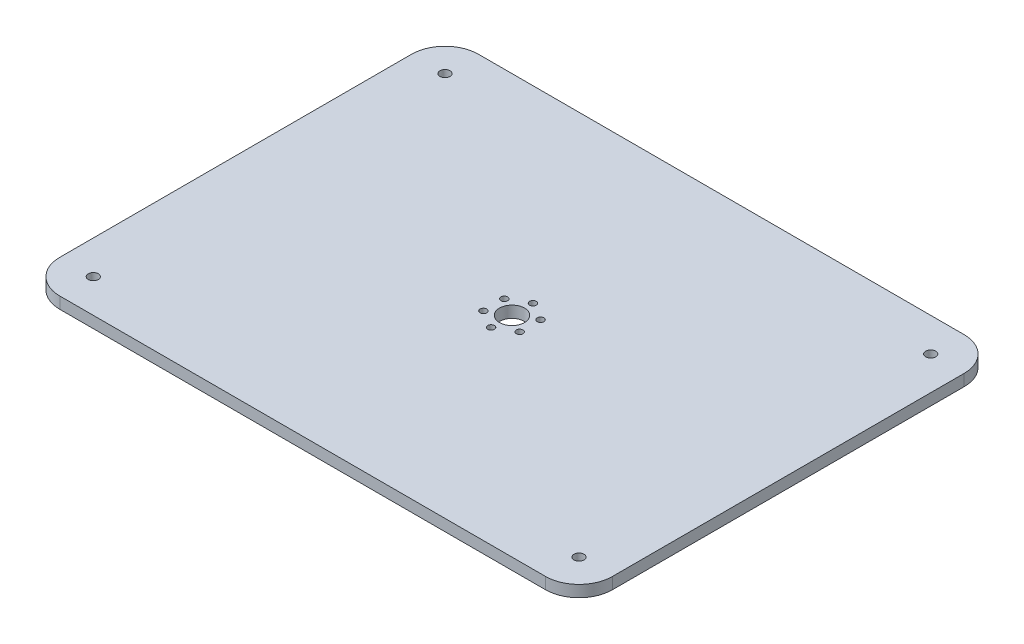
ISO-10303-21;
HEADER;
FILE_DESCRIPTION(('STEP AP214'),'2;1');
FILE_NAME('part.step','',(''),(''),'','','');
FILE_SCHEMA(('AUTOMOTIVE_DESIGN { 1 0 10303 214 1 1 1 1 }'));
ENDSEC;
DATA;
#1=APPLICATION_CONTEXT('core data for automotive mechanical design processes');
#2=APPLICATION_PROTOCOL_DEFINITION('international standard','automotive_design',2000,#1);
#3=PRODUCT_CONTEXT('',#1,'mechanical');
#4=PRODUCT('Part','Part','',(#3));
#5=PRODUCT_RELATED_PRODUCT_CATEGORY('part','',(#4));
#6=PRODUCT_DEFINITION_FORMATION('','',#4);
#7=PRODUCT_DEFINITION_CONTEXT('part definition',#1,'design');
#8=PRODUCT_DEFINITION('design','',#6,#7);
#9=PRODUCT_DEFINITION_SHAPE('','',#8);
#10=(LENGTH_UNIT() NAMED_UNIT(*) SI_UNIT(.MILLI.,.METRE.));
#11=(NAMED_UNIT(*) PLANE_ANGLE_UNIT() SI_UNIT($,.RADIAN.));
#12=(NAMED_UNIT(*) SI_UNIT($,.STERADIAN.) SOLID_ANGLE_UNIT());
#13=UNCERTAINTY_MEASURE_WITH_UNIT(LENGTH_MEASURE(1.E-05),#10,'distance_accuracy_value','');
#14=(GEOMETRIC_REPRESENTATION_CONTEXT(3) GLOBAL_UNCERTAINTY_ASSIGNED_CONTEXT((#13)) GLOBAL_UNIT_ASSIGNED_CONTEXT((#10,
#11,#12)) REPRESENTATION_CONTEXT('',''));
#15=CARTESIAN_POINT('',(0.,0.,0.));
#16=DIRECTION('',(0.,0.,1.));
#17=DIRECTION('',(1.,0.,0.));
#18=AXIS2_PLACEMENT_3D('',#15,#16,#17);
#19=CARTESIAN_POINT('',(-165.,6.9,125.));
#20=DIRECTION('',(1.,0.,0.));
#21=DIRECTION('',(0.,0.,-1.));
#22=AXIS2_PLACEMENT_3D('',#19,#20,#21);
#23=PLANE('',#22);
#24=DIRECTION('',(0.,0.,1.));
#25=VECTOR('',#24,1.);
#26=CARTESIAN_POINT('',(-165.,6.9,125.));
#27=LINE('',#26,#25);
#28=CARTESIAN_POINT('',(-165.,6.9,-105.));
#29=VERTEX_POINT('',#28);
#30=CARTESIAN_POINT('',(-165.,6.9,105.));
#31=VERTEX_POINT('',#30);
#32=EDGE_CURVE('E135',#29,#31,#27,.T.);
#33=ORIENTED_EDGE('',*,*,#32,.F.);
#34=DIRECTION('',(0.,-1.,0.));
#35=VECTOR('',#34,1.);
#36=CARTESIAN_POINT('',(-165.,6.9,-105.));
#37=LINE('',#36,#35);
#38=CARTESIAN_POINT('',(-165.,0.,-105.));
#39=VERTEX_POINT('',#38);
#40=EDGE_CURVE('E174',#29,#39,#37,.T.);
#41=ORIENTED_EDGE('',*,*,#40,.T.);
#42=DIRECTION('',(0.,0.,1.));
#43=VECTOR('',#42,1.);
#44=CARTESIAN_POINT('',(-165.,0.,125.));
#45=LINE('',#44,#43);
#46=CARTESIAN_POINT('',(-165.,0.,105.));
#47=VERTEX_POINT('',#46);
#48=EDGE_CURVE('E189',#39,#47,#45,.T.);
#49=ORIENTED_EDGE('',*,*,#48,.T.);
#50=DIRECTION('',(0.,-1.,0.));
#51=VECTOR('',#50,1.);
#52=CARTESIAN_POINT('',(-165.,6.9,105.));
#53=LINE('',#52,#51);
#54=EDGE_CURVE('E171',#47,#31,#53,.F.);
#55=ORIENTED_EDGE('',*,*,#54,.T.);
#56=EDGE_LOOP('',(#33,#41,#49,#55));
#57=FACE_BOUND('',#56,.T.);
#58=ADVANCED_FACE('F39',(#57),#23,.F.);
#59=CARTESIAN_POINT('',(-165.,6.9,125.));
#60=DIRECTION('',(0.,0.,-1.));
#61=DIRECTION('',(-1.,0.,0.));
#62=AXIS2_PLACEMENT_3D('',#59,#60,#61);
#63=PLANE('',#62);
#64=DIRECTION('',(1.,0.,0.));
#65=VECTOR('',#64,1.);
#66=CARTESIAN_POINT('',(-165.,6.9,125.));
#67=LINE('',#66,#65);
#68=CARTESIAN_POINT('',(-145.,6.9,125.));
#69=VERTEX_POINT('',#68);
#70=CARTESIAN_POINT('',(145.,6.9,125.));
#71=VERTEX_POINT('',#70);
#72=EDGE_CURVE('E140',#69,#71,#67,.T.);
#73=ORIENTED_EDGE('',*,*,#72,.F.);
#74=DIRECTION('',(0.,-1.,0.));
#75=VECTOR('',#74,1.);
#76=CARTESIAN_POINT('',(-145.,6.9,125.));
#77=LINE('',#76,#75);
#78=CARTESIAN_POINT('',(-145.,0.,125.));
#79=VERTEX_POINT('',#78);
#80=EDGE_CURVE('E11',#69,#79,#77,.T.);
#81=ORIENTED_EDGE('',*,*,#80,.T.);
#82=DIRECTION('',(1.,0.,0.));
#83=VECTOR('',#82,1.);
#84=CARTESIAN_POINT('',(-165.,0.,125.));
#85=LINE('',#84,#83);
#86=CARTESIAN_POINT('',(145.,0.,125.));
#87=VERTEX_POINT('',#86);
#88=EDGE_CURVE('E142',#79,#87,#85,.T.);
#89=ORIENTED_EDGE('',*,*,#88,.T.);
#90=DIRECTION('',(0.,-1.,0.));
#91=VECTOR('',#90,1.);
#92=CARTESIAN_POINT('',(145.,6.9,125.));
#93=LINE('',#92,#91);
#94=EDGE_CURVE('E48',#87,#71,#93,.F.);
#95=ORIENTED_EDGE('',*,*,#94,.T.);
#96=EDGE_LOOP('',(#73,#81,#89,#95));
#97=FACE_BOUND('',#96,.T.);
#98=ADVANCED_FACE('F195',(#97),#63,.F.);
#99=CARTESIAN_POINT('',(165.,6.9,125.));
#100=DIRECTION('',(-1.,0.,0.));
#101=DIRECTION('',(0.,0.,1.));
#102=AXIS2_PLACEMENT_3D('',#99,#100,#101);
#103=PLANE('',#102);
#104=DIRECTION('',(0.,0.,-1.));
#105=VECTOR('',#104,1.);
#106=CARTESIAN_POINT('',(165.,0.,125.));
#107=LINE('',#106,#105);
#108=CARTESIAN_POINT('',(165.,0.,105.));
#109=VERTEX_POINT('',#108);
#110=CARTESIAN_POINT('',(165.,0.,-105.));
#111=VERTEX_POINT('',#110);
#112=EDGE_CURVE('E136',#109,#111,#107,.T.);
#113=ORIENTED_EDGE('',*,*,#112,.T.);
#114=DIRECTION('',(0.,-1.,0.));
#115=VECTOR('',#114,1.);
#116=CARTESIAN_POINT('',(165.,6.9,-105.));
#117=LINE('',#116,#115);
#118=CARTESIAN_POINT('',(165.,6.9,-105.));
#119=VERTEX_POINT('',#118);
#120=EDGE_CURVE('E111',#111,#119,#117,.F.);
#121=ORIENTED_EDGE('',*,*,#120,.T.);
#122=DIRECTION('',(0.,0.,-1.));
#123=VECTOR('',#122,1.);
#124=CARTESIAN_POINT('',(165.,6.9,125.));
#125=LINE('',#124,#123);
#126=CARTESIAN_POINT('',(165.,6.9,105.));
#127=VERTEX_POINT('',#126);
#128=EDGE_CURVE('E180',#127,#119,#125,.T.);
#129=ORIENTED_EDGE('',*,*,#128,.F.);
#130=DIRECTION('',(0.,-1.,0.));
#131=VECTOR('',#130,1.);
#132=CARTESIAN_POINT('',(165.,6.9,105.));
#133=LINE('',#132,#131);
#134=EDGE_CURVE('E117',#127,#109,#133,.T.);
#135=ORIENTED_EDGE('',*,*,#134,.T.);
#136=EDGE_LOOP('',(#113,#121,#129,#135));
#137=FACE_BOUND('',#136,.T.);
#138=ADVANCED_FACE('F202',(#137),#103,.F.);
#139=CARTESIAN_POINT('',(-165.,6.9,-125.));
#140=DIRECTION('',(0.,0.,1.));
#141=DIRECTION('',(1.,0.,0.));
#142=AXIS2_PLACEMENT_3D('',#139,#140,#141);
#143=PLANE('',#142);
#144=DIRECTION('',(-1.,0.,0.));
#145=VECTOR('',#144,1.);
#146=CARTESIAN_POINT('',(-165.,6.9,-125.));
#147=LINE('',#146,#145);
#148=CARTESIAN_POINT('',(145.,6.9,-125.));
#149=VERTEX_POINT('',#148);
#150=CARTESIAN_POINT('',(-145.,6.9,-125.));
#151=VERTEX_POINT('',#150);
#152=EDGE_CURVE('E127',#149,#151,#147,.T.);
#153=ORIENTED_EDGE('',*,*,#152,.F.);
#154=DIRECTION('',(0.,-1.,0.));
#155=VECTOR('',#154,1.);
#156=CARTESIAN_POINT('',(145.,6.9,-125.));
#157=LINE('',#156,#155);
#158=CARTESIAN_POINT('',(145.,0.,-125.));
#159=VERTEX_POINT('',#158);
#160=EDGE_CURVE('E110',#149,#159,#157,.T.);
#161=ORIENTED_EDGE('',*,*,#160,.T.);
#162=DIRECTION('',(-1.,0.,0.));
#163=VECTOR('',#162,1.);
#164=CARTESIAN_POINT('',(-165.,0.,-125.));
#165=LINE('',#164,#163);
#166=CARTESIAN_POINT('',(-145.,0.,-125.));
#167=VERTEX_POINT('',#166);
#168=EDGE_CURVE('E124',#159,#167,#165,.T.);
#169=ORIENTED_EDGE('',*,*,#168,.T.);
#170=DIRECTION('',(0.,-1.,0.));
#171=VECTOR('',#170,1.);
#172=CARTESIAN_POINT('',(-145.,6.9,-125.));
#173=LINE('',#172,#171);
#174=EDGE_CURVE('E130',#167,#151,#173,.F.);
#175=ORIENTED_EDGE('',*,*,#174,.T.);
#176=EDGE_LOOP('',(#153,#161,#169,#175));
#177=FACE_BOUND('',#176,.T.);
#178=ADVANCED_FACE('F123',(#177),#143,.F.);
#179=CARTESIAN_POINT('',(0.,6.9,0.));
#180=DIRECTION('',(0.,-1.,0.));
#181=DIRECTION('',(0.,0.,-1.));
#182=AXIS2_PLACEMENT_3D('',#179,#180,#181);
#183=PLANE('',#182);
#184=CARTESIAN_POINT('',(0.,6.9,-12.5));
#185=DIRECTION('',(0.,1.,0.));
#186=DIRECTION('',(0.,0.,1.));
#187=AXIS2_PLACEMENT_3D('',#184,#185,#186);
#188=CIRCLE('',#187,2.);
#189=CARTESIAN_POINT('',(0.,6.9,-10.5));
#190=VERTEX_POINT('',#189);
#191=EDGE_CURVE('E471',#190,#190,#188,.T.);
#192=ORIENTED_EDGE('',*,*,#191,.F.);
#193=EDGE_LOOP('',(#192));
#194=FACE_BOUND('',#193,.T.);
#195=CARTESIAN_POINT('',(0.,6.9,0.));
#196=DIRECTION('',(0.,1.,0.));
#197=DIRECTION('',(0.,0.,1.));
#198=AXIS2_PLACEMENT_3D('',#195,#196,#197);
#199=CIRCLE('',#198,7.5);
#200=CARTESIAN_POINT('',(0.,6.9,7.5));
#201=VERTEX_POINT('',#200);
#202=EDGE_CURVE('E472',#201,#201,#199,.T.);
#203=ORIENTED_EDGE('',*,*,#202,.F.);
#204=EDGE_LOOP('',(#203));
#205=FACE_BOUND('',#204,.T.);
#206=CARTESIAN_POINT('',(-10.8253175473055,6.9,-6.24999999999999));
#207=DIRECTION('',(0.,1.,0.));
#208=DIRECTION('',(0.,0.,1.));
#209=AXIS2_PLACEMENT_3D('',#206,#207,#208);
#210=CIRCLE('',#209,2.);
#211=CARTESIAN_POINT('',(-10.8253175473055,6.9,-4.24999999999999));
#212=VERTEX_POINT('',#211);
#213=EDGE_CURVE('E480',#212,#212,#210,.T.);
#214=ORIENTED_EDGE('',*,*,#213,.F.);
#215=EDGE_LOOP('',(#214));
#216=FACE_BOUND('',#215,.T.);
#217=CARTESIAN_POINT('',(-10.8253175473055,6.9,6.25000000000001));
#218=DIRECTION('',(0.,1.,0.));
#219=DIRECTION('',(0.,0.,1.));
#220=AXIS2_PLACEMENT_3D('',#217,#218,#219);
#221=CIRCLE('',#220,2.);
#222=CARTESIAN_POINT('',(-10.8253175473055,6.9,8.25000000000001));
#223=VERTEX_POINT('',#222);
#224=EDGE_CURVE('E438',#223,#223,#221,.T.);
#225=ORIENTED_EDGE('',*,*,#224,.F.);
#226=EDGE_LOOP('',(#225));
#227=FACE_BOUND('',#226,.T.);
#228=CARTESIAN_POINT('',(0.,6.9,12.5));
#229=DIRECTION('',(0.,1.,0.));
#230=DIRECTION('',(0.,0.,1.));
#231=AXIS2_PLACEMENT_3D('',#228,#229,#230);
#232=CIRCLE('',#231,2.);
#233=CARTESIAN_POINT('',(0.,6.9,14.5));
#234=VERTEX_POINT('',#233);
#235=EDGE_CURVE('E447',#234,#234,#232,.T.);
#236=ORIENTED_EDGE('',*,*,#235,.F.);
#237=EDGE_LOOP('',(#236));
#238=FACE_BOUND('',#237,.T.);
#239=CARTESIAN_POINT('',(10.8253175473055,6.9,6.25));
#240=DIRECTION('',(0.,1.,0.));
#241=DIRECTION('',(0.,0.,1.));
#242=AXIS2_PLACEMENT_3D('',#239,#240,#241);
#243=CIRCLE('',#242,2.);
#244=CARTESIAN_POINT('',(10.8253175473055,6.9,8.25));
#245=VERTEX_POINT('',#244);
#246=EDGE_CURVE('E455',#245,#245,#243,.T.);
#247=ORIENTED_EDGE('',*,*,#246,.F.);
#248=EDGE_LOOP('',(#247));
#249=FACE_BOUND('',#248,.T.);
#250=CARTESIAN_POINT('',(10.8253175473055,6.9,-6.25000000000001));
#251=DIRECTION('',(0.,1.,0.));
#252=DIRECTION('',(0.,0.,1.));
#253=AXIS2_PLACEMENT_3D('',#250,#251,#252);
#254=CIRCLE('',#253,2.);
#255=CARTESIAN_POINT('',(10.8253175473055,6.9,-4.25000000000001));
#256=VERTEX_POINT('',#255);
#257=EDGE_CURVE('E463',#256,#256,#254,.T.);
#258=ORIENTED_EDGE('',*,*,#257,.F.);
#259=EDGE_LOOP('',(#258));
#260=FACE_BOUND('',#259,.T.);
#261=CARTESIAN_POINT('',(-145.,6.9,105.));
#262=DIRECTION('',(0.,1.,0.));
#263=DIRECTION('',(0.,0.,1.));
#264=AXIS2_PLACEMENT_3D('',#261,#262,#263);
#265=CIRCLE('',#264,2.99999999999999);
#266=CARTESIAN_POINT('',(-145.,6.9,108.));
#267=VERTEX_POINT('',#266);
#268=EDGE_CURVE('E418',#267,#267,#265,.T.);
#269=ORIENTED_EDGE('',*,*,#268,.F.);
#270=EDGE_LOOP('',(#269));
#271=FACE_BOUND('',#270,.T.);
#272=CARTESIAN_POINT('',(145.,6.9,105.));
#273=DIRECTION('',(0.,1.,0.));
#274=DIRECTION('',(0.,0.,1.));
#275=AXIS2_PLACEMENT_3D('',#272,#273,#274);
#276=CIRCLE('',#275,2.99999999999999);
#277=CARTESIAN_POINT('',(145.,6.9,108.));
#278=VERTEX_POINT('',#277);
#279=EDGE_CURVE('E427',#278,#278,#276,.T.);
#280=ORIENTED_EDGE('',*,*,#279,.F.);
#281=EDGE_LOOP('',(#280));
#282=FACE_BOUND('',#281,.T.);
#283=CARTESIAN_POINT('',(145.,6.9,-105.));
#284=DIRECTION('',(0.,1.,0.));
#285=DIRECTION('',(0.,0.,1.));
#286=AXIS2_PLACEMENT_3D('',#283,#284,#285);
#287=CIRCLE('',#286,2.99999999999999);
#288=CARTESIAN_POINT('',(145.,6.9,-102.));
#289=VERTEX_POINT('',#288);
#290=EDGE_CURVE('E415',#289,#289,#287,.T.);
#291=ORIENTED_EDGE('',*,*,#290,.F.);
#292=EDGE_LOOP('',(#291));
#293=FACE_BOUND('',#292,.T.);
#294=CARTESIAN_POINT('',(-145.,6.9,-105.));
#295=DIRECTION('',(0.,1.,0.));
#296=DIRECTION('',(0.,0.,1.));
#297=AXIS2_PLACEMENT_3D('',#294,#295,#296);
#298=CIRCLE('',#297,2.99999999999999);
#299=CARTESIAN_POINT('',(-145.,6.9,-102.));
#300=VERTEX_POINT('',#299);
#301=EDGE_CURVE('E407',#300,#300,#298,.T.);
#302=ORIENTED_EDGE('',*,*,#301,.F.);
#303=EDGE_LOOP('',(#302));
#304=FACE_BOUND('',#303,.T.);
#305=ORIENTED_EDGE('',*,*,#128,.T.);
#306=CARTESIAN_POINT('',(145.,6.9,-105.));
#307=DIRECTION('',(0.,-1.,0.));
#308=DIRECTION('',(0.,0.,-1.));
#309=AXIS2_PLACEMENT_3D('',#306,#307,#308);
#310=CIRCLE('',#309,20.);
#311=EDGE_CURVE('E168',#119,#149,#310,.F.);
#312=ORIENTED_EDGE('',*,*,#311,.T.);
#313=ORIENTED_EDGE('',*,*,#152,.T.);
#314=CARTESIAN_POINT('',(-145.,6.9,-105.));
#315=DIRECTION('',(0.,-1.,0.));
#316=DIRECTION('',(0.,0.,-1.));
#317=AXIS2_PLACEMENT_3D('',#314,#315,#316);
#318=CIRCLE('',#317,20.);
#319=EDGE_CURVE('E165',#151,#29,#318,.F.);
#320=ORIENTED_EDGE('',*,*,#319,.T.);
#321=ORIENTED_EDGE('',*,*,#32,.T.);
#322=CARTESIAN_POINT('',(-145.,6.9,105.));
#323=DIRECTION('',(0.,-1.,0.));
#324=DIRECTION('',(0.,0.,-1.));
#325=AXIS2_PLACEMENT_3D('',#322,#323,#324);
#326=CIRCLE('',#325,20.);
#327=EDGE_CURVE('E61',#31,#69,#326,.F.);
#328=ORIENTED_EDGE('',*,*,#327,.T.);
#329=ORIENTED_EDGE('',*,*,#72,.T.);
#330=CARTESIAN_POINT('',(145.,6.9,105.));
#331=DIRECTION('',(0.,-1.,0.));
#332=DIRECTION('',(0.,0.,-1.));
#333=AXIS2_PLACEMENT_3D('',#330,#331,#332);
#334=CIRCLE('',#333,20.);
#335=EDGE_CURVE('E160',#71,#127,#334,.F.);
#336=ORIENTED_EDGE('',*,*,#335,.T.);
#337=EDGE_LOOP('',(#305,#312,#313,#320,#321,#328,#329,#336));
#338=FACE_BOUND('',#337,.T.);
#339=ADVANCED_FACE('F200',(#194,#205,#216,#227,#238,#249,#260,#271,#282,#293,#304,#338),#183,.F.);
#340=CARTESIAN_POINT('',(0.,0.,0.));
#341=DIRECTION('',(0.,-1.,0.));
#342=DIRECTION('',(0.,0.,-1.));
#343=AXIS2_PLACEMENT_3D('',#340,#341,#342);
#344=PLANE('',#343);
#345=CARTESIAN_POINT('',(0.,0.,-12.5));
#346=DIRECTION('',(0.,1.,0.));
#347=DIRECTION('',(0.,0.,1.));
#348=AXIS2_PLACEMENT_3D('',#345,#346,#347);
#349=CIRCLE('',#348,2.);
#350=CARTESIAN_POINT('',(0.,0.,-10.5));
#351=VERTEX_POINT('',#350);
#352=EDGE_CURVE('E423',#351,#351,#349,.T.);
#353=ORIENTED_EDGE('',*,*,#352,.T.);
#354=EDGE_LOOP('',(#353));
#355=FACE_BOUND('',#354,.T.);
#356=CARTESIAN_POINT('',(0.,0.,0.));
#357=DIRECTION('',(0.,1.,0.));
#358=DIRECTION('',(0.,0.,1.));
#359=AXIS2_PLACEMENT_3D('',#356,#357,#358);
#360=CIRCLE('',#359,7.5);
#361=CARTESIAN_POINT('',(0.,0.,7.5));
#362=VERTEX_POINT('',#361);
#363=EDGE_CURVE('E476',#362,#362,#360,.T.);
#364=ORIENTED_EDGE('',*,*,#363,.T.);
#365=EDGE_LOOP('',(#364));
#366=FACE_BOUND('',#365,.T.);
#367=CARTESIAN_POINT('',(-10.8253175473055,0.,-6.24999999999999));
#368=DIRECTION('',(0.,1.,0.));
#369=DIRECTION('',(0.,0.,1.));
#370=AXIS2_PLACEMENT_3D('',#367,#368,#369);
#371=CIRCLE('',#370,2.);
#372=CARTESIAN_POINT('',(-10.8253175473055,0.,-4.24999999999999));
#373=VERTEX_POINT('',#372);
#374=EDGE_CURVE('E443',#373,#373,#371,.T.);
#375=ORIENTED_EDGE('',*,*,#374,.T.);
#376=EDGE_LOOP('',(#375));
#377=FACE_BOUND('',#376,.T.);
#378=CARTESIAN_POINT('',(-10.8253175473055,0.,6.25000000000001));
#379=DIRECTION('',(0.,1.,0.));
#380=DIRECTION('',(0.,0.,1.));
#381=AXIS2_PLACEMENT_3D('',#378,#379,#380);
#382=CIRCLE('',#381,2.);
#383=CARTESIAN_POINT('',(-10.8253175473055,0.,8.25000000000001));
#384=VERTEX_POINT('',#383);
#385=EDGE_CURVE('E442',#384,#384,#382,.T.);
#386=ORIENTED_EDGE('',*,*,#385,.T.);
#387=EDGE_LOOP('',(#386));
#388=FACE_BOUND('',#387,.T.);
#389=CARTESIAN_POINT('',(0.,0.,12.5));
#390=DIRECTION('',(0.,1.,0.));
#391=DIRECTION('',(0.,0.,1.));
#392=AXIS2_PLACEMENT_3D('',#389,#390,#391);
#393=CIRCLE('',#392,2.);
#394=CARTESIAN_POINT('',(0.,0.,14.5));
#395=VERTEX_POINT('',#394);
#396=EDGE_CURVE('E451',#395,#395,#393,.T.);
#397=ORIENTED_EDGE('',*,*,#396,.T.);
#398=EDGE_LOOP('',(#397));
#399=FACE_BOUND('',#398,.T.);
#400=CARTESIAN_POINT('',(10.8253175473055,0.,6.25));
#401=DIRECTION('',(0.,1.,0.));
#402=DIRECTION('',(0.,0.,1.));
#403=AXIS2_PLACEMENT_3D('',#400,#401,#402);
#404=CIRCLE('',#403,2.);
#405=CARTESIAN_POINT('',(10.8253175473055,0.,8.25));
#406=VERTEX_POINT('',#405);
#407=EDGE_CURVE('E459',#406,#406,#404,.T.);
#408=ORIENTED_EDGE('',*,*,#407,.T.);
#409=EDGE_LOOP('',(#408));
#410=FACE_BOUND('',#409,.T.);
#411=CARTESIAN_POINT('',(10.8253175473055,0.,-6.25000000000001));
#412=DIRECTION('',(0.,1.,0.));
#413=DIRECTION('',(0.,0.,1.));
#414=AXIS2_PLACEMENT_3D('',#411,#412,#413);
#415=CIRCLE('',#414,2.);
#416=CARTESIAN_POINT('',(10.8253175473055,0.,-4.25000000000001));
#417=VERTEX_POINT('',#416);
#418=EDGE_CURVE('E467',#417,#417,#415,.T.);
#419=ORIENTED_EDGE('',*,*,#418,.T.);
#420=EDGE_LOOP('',(#419));
#421=FACE_BOUND('',#420,.T.);
#422=CARTESIAN_POINT('',(-145.,0.,105.));
#423=DIRECTION('',(0.,1.,0.));
#424=DIRECTION('',(0.,0.,1.));
#425=AXIS2_PLACEMENT_3D('',#422,#423,#424);
#426=CIRCLE('',#425,2.99999999999999);
#427=CARTESIAN_POINT('',(-145.,0.,108.));
#428=VERTEX_POINT('',#427);
#429=EDGE_CURVE('E422',#428,#428,#426,.T.);
#430=ORIENTED_EDGE('',*,*,#429,.T.);
#431=EDGE_LOOP('',(#430));
#432=FACE_BOUND('',#431,.T.);
#433=CARTESIAN_POINT('',(145.,0.,105.));
#434=DIRECTION('',(0.,1.,0.));
#435=DIRECTION('',(0.,0.,1.));
#436=AXIS2_PLACEMENT_3D('',#433,#434,#435);
#437=CIRCLE('',#436,2.99999999999999);
#438=CARTESIAN_POINT('',(145.,0.,108.));
#439=VERTEX_POINT('',#438);
#440=EDGE_CURVE('E431',#439,#439,#437,.T.);
#441=ORIENTED_EDGE('',*,*,#440,.T.);
#442=EDGE_LOOP('',(#441));
#443=FACE_BOUND('',#442,.T.);
#444=CARTESIAN_POINT('',(145.,0.,-105.));
#445=DIRECTION('',(0.,1.,0.));
#446=DIRECTION('',(0.,0.,1.));
#447=AXIS2_PLACEMENT_3D('',#444,#445,#446);
#448=CIRCLE('',#447,2.99999999999999);
#449=CARTESIAN_POINT('',(145.,0.,-102.));
#450=VERTEX_POINT('',#449);
#451=EDGE_CURVE('E410',#450,#450,#448,.T.);
#452=ORIENTED_EDGE('',*,*,#451,.T.);
#453=EDGE_LOOP('',(#452));
#454=FACE_BOUND('',#453,.T.);
#455=CARTESIAN_POINT('',(-145.,0.,-105.));
#456=DIRECTION('',(0.,1.,0.));
#457=DIRECTION('',(0.,0.,1.));
#458=AXIS2_PLACEMENT_3D('',#455,#456,#457);
#459=CIRCLE('',#458,2.99999999999999);
#460=CARTESIAN_POINT('',(-145.,0.,-102.));
#461=VERTEX_POINT('',#460);
#462=EDGE_CURVE('E192',#461,#461,#459,.T.);
#463=ORIENTED_EDGE('',*,*,#462,.T.);
#464=EDGE_LOOP('',(#463));
#465=FACE_BOUND('',#464,.T.);
#466=ORIENTED_EDGE('',*,*,#168,.F.);
#467=CARTESIAN_POINT('',(145.,0.,-105.));
#468=DIRECTION('',(0.,-1.,0.));
#469=DIRECTION('',(0.,0.,-1.));
#470=AXIS2_PLACEMENT_3D('',#467,#468,#469);
#471=CIRCLE('',#470,20.);
#472=EDGE_CURVE('E106',#159,#111,#471,.T.);
#473=ORIENTED_EDGE('',*,*,#472,.T.);
#474=ORIENTED_EDGE('',*,*,#112,.F.);
#475=CARTESIAN_POINT('',(145.,0.,105.));
#476=DIRECTION('',(0.,-1.,0.));
#477=DIRECTION('',(0.,0.,-1.));
#478=AXIS2_PLACEMENT_3D('',#475,#476,#477);
#479=CIRCLE('',#478,20.);
#480=EDGE_CURVE('E129',#109,#87,#479,.T.);
#481=ORIENTED_EDGE('',*,*,#480,.T.);
#482=ORIENTED_EDGE('',*,*,#88,.F.);
#483=CARTESIAN_POINT('',(-145.,0.,105.));
#484=DIRECTION('',(0.,-1.,0.));
#485=DIRECTION('',(0.,0.,-1.));
#486=AXIS2_PLACEMENT_3D('',#483,#484,#485);
#487=CIRCLE('',#486,20.);
#488=EDGE_CURVE('E150',#79,#47,#487,.T.);
#489=ORIENTED_EDGE('',*,*,#488,.T.);
#490=ORIENTED_EDGE('',*,*,#48,.F.);
#491=CARTESIAN_POINT('',(-145.,0.,-105.));
#492=DIRECTION('',(0.,-1.,0.));
#493=DIRECTION('',(0.,0.,-1.));
#494=AXIS2_PLACEMENT_3D('',#491,#492,#493);
#495=CIRCLE('',#494,20.);
#496=EDGE_CURVE('E118',#39,#167,#495,.T.);
#497=ORIENTED_EDGE('',*,*,#496,.T.);
#498=EDGE_LOOP('',(#466,#473,#474,#481,#482,#489,#490,#497));
#499=FACE_BOUND('',#498,.T.);
#500=ADVANCED_FACE('F132',(#355,#366,#377,#388,#399,#410,#421,#432,#443,#454,#465,#499),#344,.T.);
#501=CARTESIAN_POINT('',(-145.,0.,-105.));
#502=DIRECTION('',(0.,1.,0.));
#503=DIRECTION('',(0.,0.,1.));
#504=AXIS2_PLACEMENT_3D('',#501,#502,#503);
#505=CYLINDRICAL_SURFACE('',#504,2.99999999999999);
#506=ORIENTED_EDGE('',*,*,#462,.F.);
#507=EDGE_LOOP('',(#506));
#508=FACE_BOUND('',#507,.T.);
#509=ORIENTED_EDGE('',*,*,#301,.T.);
#510=EDGE_LOOP('',(#509));
#511=FACE_BOUND('',#510,.T.);
#512=ADVANCED_FACE('F262',(#508,#511),#505,.F.);
#513=CARTESIAN_POINT('',(145.,0.,-105.));
#514=DIRECTION('',(0.,1.,0.));
#515=DIRECTION('',(0.,0.,1.));
#516=AXIS2_PLACEMENT_3D('',#513,#514,#515);
#517=CYLINDRICAL_SURFACE('',#516,2.99999999999999);
#518=ORIENTED_EDGE('',*,*,#451,.F.);
#519=EDGE_LOOP('',(#518));
#520=FACE_BOUND('',#519,.T.);
#521=ORIENTED_EDGE('',*,*,#290,.T.);
#522=EDGE_LOOP('',(#521));
#523=FACE_BOUND('',#522,.T.);
#524=ADVANCED_FACE('F381',(#520,#523),#517,.F.);
#525=CARTESIAN_POINT('',(145.,0.,105.));
#526=DIRECTION('',(0.,1.,0.));
#527=DIRECTION('',(0.,0.,1.));
#528=AXIS2_PLACEMENT_3D('',#525,#526,#527);
#529=CYLINDRICAL_SURFACE('',#528,2.99999999999999);
#530=ORIENTED_EDGE('',*,*,#440,.F.);
#531=EDGE_LOOP('',(#530));
#532=FACE_BOUND('',#531,.T.);
#533=ORIENTED_EDGE('',*,*,#279,.T.);
#534=EDGE_LOOP('',(#533));
#535=FACE_BOUND('',#534,.T.);
#536=ADVANCED_FACE('F371',(#532,#535),#529,.F.);
#537=CARTESIAN_POINT('',(-145.,0.,105.));
#538=DIRECTION('',(0.,1.,0.));
#539=DIRECTION('',(0.,0.,1.));
#540=AXIS2_PLACEMENT_3D('',#537,#538,#539);
#541=CYLINDRICAL_SURFACE('',#540,2.99999999999999);
#542=ORIENTED_EDGE('',*,*,#429,.F.);
#543=EDGE_LOOP('',(#542));
#544=FACE_BOUND('',#543,.T.);
#545=ORIENTED_EDGE('',*,*,#268,.T.);
#546=EDGE_LOOP('',(#545));
#547=FACE_BOUND('',#546,.T.);
#548=ADVANCED_FACE('F361',(#544,#547),#541,.F.);
#549=CARTESIAN_POINT('',(10.8253175473055,0.,-6.25000000000001));
#550=DIRECTION('',(0.,1.,0.));
#551=DIRECTION('',(0.,0.,1.));
#552=AXIS2_PLACEMENT_3D('',#549,#550,#551);
#553=CYLINDRICAL_SURFACE('',#552,2.);
#554=ORIENTED_EDGE('',*,*,#418,.F.);
#555=EDGE_LOOP('',(#554));
#556=FACE_BOUND('',#555,.T.);
#557=ORIENTED_EDGE('',*,*,#257,.T.);
#558=EDGE_LOOP('',(#557));
#559=FACE_BOUND('',#558,.T.);
#560=ADVANCED_FACE('F351',(#556,#559),#553,.F.);
#561=CARTESIAN_POINT('',(10.8253175473055,0.,6.25));
#562=DIRECTION('',(0.,1.,0.));
#563=DIRECTION('',(0.,0.,1.));
#564=AXIS2_PLACEMENT_3D('',#561,#562,#563);
#565=CYLINDRICAL_SURFACE('',#564,2.);
#566=ORIENTED_EDGE('',*,*,#407,.F.);
#567=EDGE_LOOP('',(#566));
#568=FACE_BOUND('',#567,.T.);
#569=ORIENTED_EDGE('',*,*,#246,.T.);
#570=EDGE_LOOP('',(#569));
#571=FACE_BOUND('',#570,.T.);
#572=ADVANCED_FACE('F341',(#568,#571),#565,.F.);
#573=CARTESIAN_POINT('',(0.,0.,12.5));
#574=DIRECTION('',(0.,1.,0.));
#575=DIRECTION('',(0.,0.,1.));
#576=AXIS2_PLACEMENT_3D('',#573,#574,#575);
#577=CYLINDRICAL_SURFACE('',#576,2.);
#578=ORIENTED_EDGE('',*,*,#396,.F.);
#579=EDGE_LOOP('',(#578));
#580=FACE_BOUND('',#579,.T.);
#581=ORIENTED_EDGE('',*,*,#235,.T.);
#582=EDGE_LOOP('',(#581));
#583=FACE_BOUND('',#582,.T.);
#584=ADVANCED_FACE('F331',(#580,#583),#577,.F.);
#585=CARTESIAN_POINT('',(-10.8253175473055,0.,6.25000000000001));
#586=DIRECTION('',(0.,1.,0.));
#587=DIRECTION('',(0.,0.,1.));
#588=AXIS2_PLACEMENT_3D('',#585,#586,#587);
#589=CYLINDRICAL_SURFACE('',#588,2.);
#590=ORIENTED_EDGE('',*,*,#385,.F.);
#591=EDGE_LOOP('',(#590));
#592=FACE_BOUND('',#591,.T.);
#593=ORIENTED_EDGE('',*,*,#224,.T.);
#594=EDGE_LOOP('',(#593));
#595=FACE_BOUND('',#594,.T.);
#596=ADVANCED_FACE('F321',(#592,#595),#589,.F.);
#597=CARTESIAN_POINT('',(-10.8253175473055,0.,-6.24999999999999));
#598=DIRECTION('',(0.,1.,0.));
#599=DIRECTION('',(0.,0.,1.));
#600=AXIS2_PLACEMENT_3D('',#597,#598,#599);
#601=CYLINDRICAL_SURFACE('',#600,2.);
#602=ORIENTED_EDGE('',*,*,#374,.F.);
#603=EDGE_LOOP('',(#602));
#604=FACE_BOUND('',#603,.T.);
#605=ORIENTED_EDGE('',*,*,#213,.T.);
#606=EDGE_LOOP('',(#605));
#607=FACE_BOUND('',#606,.T.);
#608=ADVANCED_FACE('F311',(#604,#607),#601,.F.);
#609=CARTESIAN_POINT('',(0.,0.,0.));
#610=DIRECTION('',(0.,1.,0.));
#611=DIRECTION('',(0.,0.,1.));
#612=AXIS2_PLACEMENT_3D('',#609,#610,#611);
#613=CYLINDRICAL_SURFACE('',#612,7.5);
#614=ORIENTED_EDGE('',*,*,#363,.F.);
#615=EDGE_LOOP('',(#614));
#616=FACE_BOUND('',#615,.T.);
#617=ORIENTED_EDGE('',*,*,#202,.T.);
#618=EDGE_LOOP('',(#617));
#619=FACE_BOUND('',#618,.T.);
#620=ADVANCED_FACE('F301',(#616,#619),#613,.F.);
#621=CARTESIAN_POINT('',(0.,0.,-12.5));
#622=DIRECTION('',(0.,1.,0.));
#623=DIRECTION('',(0.,0.,1.));
#624=AXIS2_PLACEMENT_3D('',#621,#622,#623);
#625=CYLINDRICAL_SURFACE('',#624,2.);
#626=ORIENTED_EDGE('',*,*,#352,.F.);
#627=EDGE_LOOP('',(#626));
#628=FACE_BOUND('',#627,.T.);
#629=ORIENTED_EDGE('',*,*,#191,.T.);
#630=EDGE_LOOP('',(#629));
#631=FACE_BOUND('',#630,.T.);
#632=ADVANCED_FACE('F221',(#628,#631),#625,.F.);
#633=CARTESIAN_POINT('',(145.,6.9,-105.));
#634=DIRECTION('',(0.,-1.,0.));
#635=DIRECTION('',(0.,0.,-1.));
#636=AXIS2_PLACEMENT_3D('',#633,#634,#635);
#637=CYLINDRICAL_SURFACE('',#636,20.);
#638=ORIENTED_EDGE('',*,*,#311,.F.);
#639=ORIENTED_EDGE('',*,*,#120,.F.);
#640=ORIENTED_EDGE('',*,*,#472,.F.);
#641=ORIENTED_EDGE('',*,*,#160,.F.);
#642=EDGE_LOOP('',(#638,#639,#640,#641));
#643=FACE_BOUND('',#642,.T.);
#644=ADVANCED_FACE('F109',(#643),#637,.T.);
#645=CARTESIAN_POINT('',(-145.,6.9,-105.));
#646=DIRECTION('',(0.,-1.,0.));
#647=DIRECTION('',(0.,0.,-1.));
#648=AXIS2_PLACEMENT_3D('',#645,#646,#647);
#649=CYLINDRICAL_SURFACE('',#648,20.);
#650=ORIENTED_EDGE('',*,*,#319,.F.);
#651=ORIENTED_EDGE('',*,*,#174,.F.);
#652=ORIENTED_EDGE('',*,*,#496,.F.);
#653=ORIENTED_EDGE('',*,*,#40,.F.);
#654=EDGE_LOOP('',(#650,#651,#652,#653));
#655=FACE_BOUND('',#654,.T.);
#656=ADVANCED_FACE('F220',(#655),#649,.T.);
#657=CARTESIAN_POINT('',(-145.,6.9,105.));
#658=DIRECTION('',(0.,-1.,0.));
#659=DIRECTION('',(0.,0.,-1.));
#660=AXIS2_PLACEMENT_3D('',#657,#658,#659);
#661=CYLINDRICAL_SURFACE('',#660,20.);
#662=ORIENTED_EDGE('',*,*,#327,.F.);
#663=ORIENTED_EDGE('',*,*,#54,.F.);
#664=ORIENTED_EDGE('',*,*,#488,.F.);
#665=ORIENTED_EDGE('',*,*,#80,.F.);
#666=EDGE_LOOP('',(#662,#663,#664,#665));
#667=FACE_BOUND('',#666,.T.);
#668=ADVANCED_FACE('F223',(#667),#661,.T.);
#669=CARTESIAN_POINT('',(145.,6.9,105.));
#670=DIRECTION('',(0.,-1.,0.));
#671=DIRECTION('',(0.,0.,-1.));
#672=AXIS2_PLACEMENT_3D('',#669,#670,#671);
#673=CYLINDRICAL_SURFACE('',#672,20.);
#674=ORIENTED_EDGE('',*,*,#335,.F.);
#675=ORIENTED_EDGE('',*,*,#94,.F.);
#676=ORIENTED_EDGE('',*,*,#480,.F.);
#677=ORIENTED_EDGE('',*,*,#134,.F.);
#678=EDGE_LOOP('',(#674,#675,#676,#677));
#679=FACE_BOUND('',#678,.T.);
#680=ADVANCED_FACE('F41',(#679),#673,.T.);
#681=CLOSED_SHELL('',(#58,#98,#138,#178,#339,#500,#512,#524,#536,#548,#560,#572,#584,#596,#608,
#620,#632,#644,#656,#668,#680));
#682=MANIFOLD_SOLID_BREP('B2',#681);
#683=ADVANCED_BREP_SHAPE_REPRESENTATION('',(#18,#682),#14);
#684=SHAPE_DEFINITION_REPRESENTATION(#9,#683);
ENDSEC;
END-ISO-10303-21;
